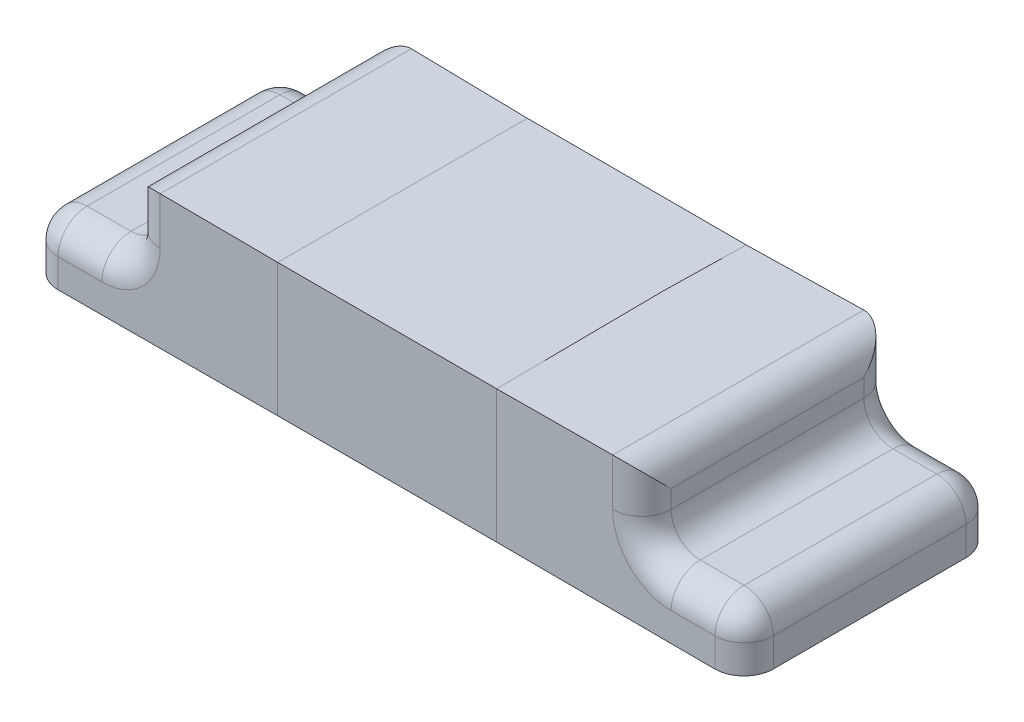
ISO-10303-21;
HEADER;
FILE_DESCRIPTION(('STEP AP214'),'2;1');
FILE_NAME('part.step','',(''),(''),'','','');
FILE_SCHEMA(('AUTOMOTIVE_DESIGN { 1 0 10303 214 1 1 1 1 }'));
ENDSEC;
DATA;
#1=APPLICATION_CONTEXT('core data for automotive mechanical design processes');
#2=APPLICATION_PROTOCOL_DEFINITION('international standard','automotive_design',2000,#1);
#3=PRODUCT_CONTEXT('',#1,'mechanical');
#4=PRODUCT('Part','Part','',(#3));
#5=PRODUCT_RELATED_PRODUCT_CATEGORY('part','',(#4));
#6=PRODUCT_DEFINITION_FORMATION('','',#4);
#7=PRODUCT_DEFINITION_CONTEXT('part definition',#1,'design');
#8=PRODUCT_DEFINITION('design','',#6,#7);
#9=PRODUCT_DEFINITION_SHAPE('','',#8);
#10=(LENGTH_UNIT() NAMED_UNIT(*) SI_UNIT(.MILLI.,.METRE.));
#11=(NAMED_UNIT(*) PLANE_ANGLE_UNIT() SI_UNIT($,.RADIAN.));
#12=(NAMED_UNIT(*) SI_UNIT($,.STERADIAN.) SOLID_ANGLE_UNIT());
#13=UNCERTAINTY_MEASURE_WITH_UNIT(LENGTH_MEASURE(1.E-05),#10,'distance_accuracy_value','');
#14=(GEOMETRIC_REPRESENTATION_CONTEXT(3) GLOBAL_UNCERTAINTY_ASSIGNED_CONTEXT((#13)) GLOBAL_UNIT_ASSIGNED_CONTEXT((#10,
#11,#12)) REPRESENTATION_CONTEXT('',''));
#15=CARTESIAN_POINT('',(0.,0.,0.));
#16=DIRECTION('',(0.,0.,1.));
#17=DIRECTION('',(1.,0.,0.));
#18=AXIS2_PLACEMENT_3D('',#15,#16,#17);
#19=CARTESIAN_POINT('',(0.875,0.,0.));
#20=DIRECTION('',(-1.,0.,0.));
#21=DIRECTION('',(0.,0.,1.));
#22=AXIS2_PLACEMENT_3D('',#19,#20,#21);
#23=PLANE('',#22);
#24=DIRECTION('',(0.,1.,0.));
#25=VECTOR('',#24,1.);
#26=CARTESIAN_POINT('',(0.875,0.,-0.33));
#27=LINE('',#26,#25);
#28=CARTESIAN_POINT('',(0.875,0.298442990090282,-0.33));
#29=VERTEX_POINT('',#28);
#30=CARTESIAN_POINT('',(0.875,0.36,-0.33));
#31=VERTEX_POINT('',#30);
#32=EDGE_CURVE('E508',#29,#31,#27,.T.);
#33=ORIENTED_EDGE('',*,*,#32,.T.);
#34=DIRECTION('',(0.,0.,1.));
#35=VECTOR('',#34,1.);
#36=CARTESIAN_POINT('',(0.875,0.36,0.));
#37=LINE('',#36,#35);
#38=CARTESIAN_POINT('',(0.875,0.36,0.33));
#39=VERTEX_POINT('',#38);
#40=EDGE_CURVE('E483',#31,#39,#37,.T.);
#41=ORIENTED_EDGE('',*,*,#40,.T.);
#42=DIRECTION('',(0.,-1.,0.));
#43=VECTOR('',#42,1.);
#44=CARTESIAN_POINT('',(0.875,0.,0.33));
#45=LINE('',#44,#43);
#46=CARTESIAN_POINT('',(0.875,0.298442990090282,0.33));
#47=VERTEX_POINT('',#46);
#48=EDGE_CURVE('E511',#39,#47,#45,.T.);
#49=ORIENTED_EDGE('',*,*,#48,.T.);
#50=DIRECTION('',(0.,0.,1.));
#51=VECTOR('',#50,1.);
#52=CARTESIAN_POINT('',(0.875,0.298442990090282,-0.43));
#53=LINE('',#52,#51);
#54=EDGE_CURVE('E273',#47,#29,#53,.F.);
#55=ORIENTED_EDGE('',*,*,#54,.T.);
#56=EDGE_LOOP('',(#33,#41,#49,#55));
#57=FACE_BOUND('',#56,.T.);
#58=ADVANCED_FACE('F40',(#57),#23,.F.);
#59=CARTESIAN_POINT('',(0.375,0.,-0.425));
#60=DIRECTION('',(0.,0.,1.));
#61=DIRECTION('',(1.,0.,0.));
#62=AXIS2_PLACEMENT_3D('',#59,#60,#61);
#63=PLANE('',#62);
#64=CARTESIAN_POINT('',(-0.375,0.,-0.425));
#65=DIRECTION('',(0.,1.,0.));
#66=VECTOR('',#65,1.);
#67=LINE('',#64,#66);
#68=CARTESIAN_POINT('',(-0.375,0.,-0.4275));
#69=VERTEX_POINT('',#68);
#70=CARTESIAN_POINT('',(-0.375,0.455,-0.4275));
#71=VERTEX_POINT('',#70);
#72=EDGE_CURVE('E233',#69,#71,#67,.T.);
#73=ORIENTED_EDGE('',*,*,#72,.T.);
#74=DIRECTION('',(-1.,0.,0.));
#75=VECTOR('',#74,1.);
#76=CARTESIAN_POINT('',(0.375,0.45,-0.425));
#77=LINE('',#76,#75);
#78=CARTESIAN_POINT('',(0.375,0.454472135955,-0.4272360679775));
#79=VERTEX_POINT('',#78);
#80=EDGE_CURVE('E270',#79,#71,#77,.T.);
#81=ORIENTED_EDGE('',*,*,#80,.F.);
#82=CARTESIAN_POINT('',(0.375,0.,-0.43));
#83=DIRECTION('',(0.,1.,0.));
#84=VECTOR('',#83,1.);
#85=LINE('',#82,#84);
#86=CARTESIAN_POINT('',(0.375,0.,-0.4275));
#87=VERTEX_POINT('',#86);
#88=EDGE_CURVE('E249',#87,#79,#85,.T.);
#89=ORIENTED_EDGE('',*,*,#88,.F.);
#90=DIRECTION('',(-1.,0.,0.));
#91=VECTOR('',#90,1.);
#92=CARTESIAN_POINT('',(0.375,0.,-0.425));
#93=LINE('',#92,#91);
#94=EDGE_CURVE('E222',#87,#69,#93,.T.);
#95=ORIENTED_EDGE('',*,*,#94,.T.);
#96=EDGE_LOOP('',(#73,#81,#89,#95));
#97=FACE_BOUND('',#96,.T.);
#98=ADVANCED_FACE('F247',(#97),#63,.F.);
#99=CARTESIAN_POINT('',(0.375,0.45,0.425));
#100=DIRECTION('',(0.,-1.,0.));
#101=DIRECTION('',(0.,0.,-1.));
#102=AXIS2_PLACEMENT_3D('',#99,#100,#101);
#103=PLANE('',#102);
#104=CARTESIAN_POINT('',(-0.375,0.45,-0.425));
#105=DIRECTION('',(0.,0.,1.));
#106=VECTOR('',#105,1.);
#107=LINE('',#104,#106);
#108=CARTESIAN_POINT('',(-0.375,0.455,0.4275));
#109=VERTEX_POINT('',#108);
#110=EDGE_CURVE('E243',#71,#109,#107,.T.);
#111=ORIENTED_EDGE('',*,*,#110,.T.);
#112=DIRECTION('',(-1.,0.,0.));
#113=VECTOR('',#112,1.);
#114=CARTESIAN_POINT('',(0.375,0.45,0.425));
#115=LINE('',#114,#113);
#116=CARTESIAN_POINT('',(0.375,0.455,0.4275));
#117=VERTEX_POINT('',#116);
#118=EDGE_CURVE('E255',#117,#109,#115,.T.);
#119=ORIENTED_EDGE('',*,*,#118,.F.);
#120=DIRECTION('',(0.,0.,1.));
#121=VECTOR('',#120,1.);
#122=CARTESIAN_POINT('',(0.375,0.45,0.425));
#123=LINE('',#122,#121);
#124=EDGE_CURVE('E258',#79,#117,#123,.T.);
#125=ORIENTED_EDGE('',*,*,#124,.F.);
#126=ORIENTED_EDGE('',*,*,#80,.T.);
#127=EDGE_LOOP('',(#111,#119,#125,#126));
#128=FACE_BOUND('',#127,.T.);
#129=ADVANCED_FACE('F297',(#128),#103,.F.);
#130=CARTESIAN_POINT('',(0.375,0.,0.425));
#131=DIRECTION('',(0.,0.,-1.));
#132=DIRECTION('',(-1.,0.,0.));
#133=AXIS2_PLACEMENT_3D('',#130,#131,#132);
#134=PLANE('',#133);
#135=CARTESIAN_POINT('',(-0.375,0.45,0.425));
#136=DIRECTION('',(0.,-1.,0.));
#137=VECTOR('',#136,1.);
#138=LINE('',#135,#137);
#139=CARTESIAN_POINT('',(-0.375,0.,0.4275));
#140=VERTEX_POINT('',#139);
#141=EDGE_CURVE('E338',#109,#140,#138,.T.);
#142=ORIENTED_EDGE('',*,*,#141,.T.);
#143=DIRECTION('',(-1.,0.,0.));
#144=VECTOR('',#143,1.);
#145=CARTESIAN_POINT('',(0.375,0.,0.425));
#146=LINE('',#145,#144);
#147=CARTESIAN_POINT('',(0.375,0.,0.4275));
#148=VERTEX_POINT('',#147);
#149=EDGE_CURVE('E251',#148,#140,#146,.T.);
#150=ORIENTED_EDGE('',*,*,#149,.F.);
#151=CARTESIAN_POINT('',(0.375,0.46,0.43));
#152=DIRECTION('',(0.,-1.,0.));
#153=VECTOR('',#152,1.);
#154=LINE('',#151,#153);
#155=EDGE_CURVE('E252',#117,#148,#154,.T.);
#156=ORIENTED_EDGE('',*,*,#155,.F.);
#157=ORIENTED_EDGE('',*,*,#118,.T.);
#158=EDGE_LOOP('',(#142,#150,#156,#157));
#159=FACE_BOUND('',#158,.T.);
#160=ADVANCED_FACE('F287',(#159),#134,.F.);
#161=CARTESIAN_POINT('',(0.375,0.,0.425));
#162=DIRECTION('',(0.,1.,0.));
#163=DIRECTION('',(0.,0.,1.));
#164=AXIS2_PLACEMENT_3D('',#161,#162,#163);
#165=PLANE('',#164);
#166=DIRECTION('',(0.,0.,-1.));
#167=VECTOR('',#166,1.);
#168=CARTESIAN_POINT('',(-1.225,0.,0.43));
#169=LINE('',#168,#167);
#170=CARTESIAN_POINT('',(-1.225,0.,0.33));
#171=VERTEX_POINT('',#170);
#172=CARTESIAN_POINT('',(-1.225,0.,-0.33));
#173=VERTEX_POINT('',#172);
#174=EDGE_CURVE('E327',#171,#173,#169,.T.);
#175=ORIENTED_EDGE('',*,*,#174,.T.);
#176=CARTESIAN_POINT('',(-1.125,0.,-0.33));
#177=DIRECTION('',(0.,1.,0.));
#178=DIRECTION('',(0.,0.,1.));
#179=AXIS2_PLACEMENT_3D('',#176,#177,#178);
#180=CIRCLE('',#179,0.1);
#181=CARTESIAN_POINT('',(-1.125,0.,-0.43));
#182=VERTEX_POINT('',#181);
#183=EDGE_CURVE('E225',#173,#182,#180,.F.);
#184=ORIENTED_EDGE('',*,*,#183,.T.);
#185=DIRECTION('',(1.,0.,0.));
#186=VECTOR('',#185,1.);
#187=CARTESIAN_POINT('',(-0.875,0.,-0.43));
#188=LINE('',#187,#186);
#189=EDGE_CURVE('E216',#182,#69,#188,.T.);
#190=ORIENTED_EDGE('',*,*,#189,.T.);
#191=ORIENTED_EDGE('',*,*,#94,.F.);
#192=DIRECTION('',(-1.,0.,0.));
#193=VECTOR('',#192,1.);
#194=CARTESIAN_POINT('',(0.875,0.,-0.43));
#195=LINE('',#194,#193);
#196=CARTESIAN_POINT('',(1.125,0.,-0.43));
#197=VERTEX_POINT('',#196);
#198=EDGE_CURVE('E465',#197,#87,#195,.T.);
#199=ORIENTED_EDGE('',*,*,#198,.F.);
#200=CARTESIAN_POINT('',(1.125,0.,-0.33));
#201=DIRECTION('',(0.,1.,0.));
#202=DIRECTION('',(0.,0.,1.));
#203=AXIS2_PLACEMENT_3D('',#200,#201,#202);
#204=CIRCLE('',#203,0.1);
#205=CARTESIAN_POINT('',(1.225,0.,-0.33));
#206=VERTEX_POINT('',#205);
#207=EDGE_CURVE('E663',#197,#206,#204,.F.);
#208=ORIENTED_EDGE('',*,*,#207,.T.);
#209=DIRECTION('',(0.,0.,-1.));
#210=VECTOR('',#209,1.);
#211=CARTESIAN_POINT('',(1.225,0.,0.43));
#212=LINE('',#211,#210);
#213=CARTESIAN_POINT('',(1.225,0.,0.33));
#214=VERTEX_POINT('',#213);
#215=EDGE_CURVE('E458',#214,#206,#212,.T.);
#216=ORIENTED_EDGE('',*,*,#215,.F.);
#217=CARTESIAN_POINT('',(1.125,0.,0.33));
#218=DIRECTION('',(0.,1.,0.));
#219=DIRECTION('',(0.,0.,1.));
#220=AXIS2_PLACEMENT_3D('',#217,#218,#219);
#221=CIRCLE('',#220,0.1);
#222=CARTESIAN_POINT('',(1.125,0.,0.43));
#223=VERTEX_POINT('',#222);
#224=EDGE_CURVE('E659',#214,#223,#221,.F.);
#225=ORIENTED_EDGE('',*,*,#224,.T.);
#226=DIRECTION('',(-1.,0.,0.));
#227=VECTOR('',#226,1.);
#228=CARTESIAN_POINT('',(0.875,0.,0.43));
#229=LINE('',#228,#227);
#230=EDGE_CURVE('E409',#223,#148,#229,.T.);
#231=ORIENTED_EDGE('',*,*,#230,.T.);
#232=ORIENTED_EDGE('',*,*,#149,.T.);
#233=DIRECTION('',(1.,0.,0.));
#234=VECTOR('',#233,1.);
#235=CARTESIAN_POINT('',(-0.875,0.,0.43));
#236=LINE('',#235,#234);
#237=CARTESIAN_POINT('',(-1.125,0.,0.43));
#238=VERTEX_POINT('',#237);
#239=EDGE_CURVE('E230',#238,#140,#236,.T.);
#240=ORIENTED_EDGE('',*,*,#239,.F.);
#241=CARTESIAN_POINT('',(-1.125,0.,0.33));
#242=DIRECTION('',(0.,1.,0.));
#243=DIRECTION('',(0.,0.,1.));
#244=AXIS2_PLACEMENT_3D('',#241,#242,#243);
#245=CIRCLE('',#244,0.1);
#246=EDGE_CURVE('E63',#238,#171,#245,.F.);
#247=ORIENTED_EDGE('',*,*,#246,.T.);
#248=EDGE_LOOP('',(#175,#184,#190,#191,#199,#208,#216,#225,#231,#232,#240,#247));
#249=FACE_BOUND('',#248,.T.);
#250=ADVANCED_FACE('F219',(#249),#165,.F.);
#251=CARTESIAN_POINT('',(0.875,0.,-0.43));
#252=DIRECTION('',(0.,0.,1.));
#253=DIRECTION('',(1.,0.,0.));
#254=AXIS2_PLACEMENT_3D('',#251,#252,#253);
#255=PLANE('',#254);
#256=DIRECTION('',(-1.,0.,0.));
#257=VECTOR('',#256,1.);
#258=CARTESIAN_POINT('',(0.875,0.098442990090282,-0.43));
#259=LINE('',#258,#257);
#260=CARTESIAN_POINT('',(0.975,0.098442990090282,-0.43));
#261=VERTEX_POINT('',#260);
#262=CARTESIAN_POINT('',(1.125,0.098442990090282,-0.43));
#263=VERTEX_POINT('',#262);
#264=EDGE_CURVE('E485',#261,#263,#259,.F.);
#265=ORIENTED_EDGE('',*,*,#264,.T.);
#266=DIRECTION('',(0.,1.,0.));
#267=VECTOR('',#266,1.);
#268=CARTESIAN_POINT('',(1.125,0.,-0.43));
#269=LINE('',#268,#267);
#270=EDGE_CURVE('E464',#263,#197,#269,.F.);
#271=ORIENTED_EDGE('',*,*,#270,.T.);
#272=ORIENTED_EDGE('',*,*,#198,.T.);
#273=ORIENTED_EDGE('',*,*,#88,.T.);
#274=DIRECTION('',(-1.,0.,0.));
#275=VECTOR('',#274,1.);
#276=CARTESIAN_POINT('',(0.875,0.46,-0.43));
#277=LINE('',#276,#275);
#278=CARTESIAN_POINT('',(0.775,0.46,-0.43));
#279=VERTEX_POINT('',#278);
#280=EDGE_CURVE('E244',#279,#79,#277,.T.);
#281=ORIENTED_EDGE('',*,*,#280,.F.);
#282=DIRECTION('',(0.,1.,0.));
#283=VECTOR('',#282,1.);
#284=CARTESIAN_POINT('',(0.775,0.,-0.43));
#285=LINE('',#284,#283);
#286=CARTESIAN_POINT('',(0.775,0.298442990090282,-0.43));
#287=VERTEX_POINT('',#286);
#288=EDGE_CURVE('E410',#279,#287,#285,.F.);
#289=ORIENTED_EDGE('',*,*,#288,.T.);
#290=CARTESIAN_POINT('',(0.975,0.298442990090282,-0.43));
#291=DIRECTION('',(0.,0.,1.));
#292=DIRECTION('',(1.,0.,0.));
#293=AXIS2_PLACEMENT_3D('',#290,#291,#292);
#294=CIRCLE('',#293,0.2);
#295=EDGE_CURVE('E487',#261,#287,#294,.F.);
#296=ORIENTED_EDGE('',*,*,#295,.F.);
#297=EDGE_LOOP('',(#265,#271,#272,#273,#281,#289,#296));
#298=FACE_BOUND('',#297,.T.);
#299=ADVANCED_FACE('F495',(#298),#255,.F.);
#300=CARTESIAN_POINT('',(0.875,0.46,0.43));
#301=DIRECTION('',(0.,-1.,0.));
#302=DIRECTION('',(0.,0.,-1.));
#303=AXIS2_PLACEMENT_3D('',#300,#301,#302);
#304=PLANE('',#303);
#305=DIRECTION('',(-1.,0.,0.));
#306=VECTOR('',#305,1.);
#307=CARTESIAN_POINT('',(0.875,0.46,0.43));
#308=LINE('',#307,#306);
#309=CARTESIAN_POINT('',(0.775,0.46,0.43));
#310=VERTEX_POINT('',#309);
#311=EDGE_CURVE('E406',#310,#117,#308,.T.);
#312=ORIENTED_EDGE('',*,*,#311,.F.);
#313=DIRECTION('',(0.,0.,1.));
#314=VECTOR('',#313,1.);
#315=CARTESIAN_POINT('',(0.775,0.46,0.43));
#316=LINE('',#315,#314);
#317=EDGE_CURVE('E419',#310,#279,#316,.F.);
#318=ORIENTED_EDGE('',*,*,#317,.T.);
#319=ORIENTED_EDGE('',*,*,#280,.T.);
#320=DIRECTION('',(0.,0.,1.));
#321=VECTOR('',#320,1.);
#322=CARTESIAN_POINT('',(0.375,0.46,0.43));
#323=LINE('',#322,#321);
#324=EDGE_CURVE('E468',#79,#117,#323,.T.);
#325=ORIENTED_EDGE('',*,*,#324,.T.);
#326=EDGE_LOOP('',(#312,#318,#319,#325));
#327=FACE_BOUND('',#326,.T.);
#328=ADVANCED_FACE('F389',(#327),#304,.F.);
#329=CARTESIAN_POINT('',(0.875,0.,0.43));
#330=DIRECTION('',(0.,0.,-1.));
#331=DIRECTION('',(-1.,0.,0.));
#332=AXIS2_PLACEMENT_3D('',#329,#330,#331);
#333=PLANE('',#332);
#334=ORIENTED_EDGE('',*,*,#230,.F.);
#335=DIRECTION('',(0.,-1.,0.));
#336=VECTOR('',#335,1.);
#337=CARTESIAN_POINT('',(1.125,0.,0.43));
#338=LINE('',#337,#336);
#339=CARTESIAN_POINT('',(1.125,0.098442990090282,0.43));
#340=VERTEX_POINT('',#339);
#341=EDGE_CURVE('E665',#223,#340,#338,.F.);
#342=ORIENTED_EDGE('',*,*,#341,.T.);
#343=DIRECTION('',(-1.,0.,0.));
#344=VECTOR('',#343,1.);
#345=CARTESIAN_POINT('',(0.875,0.098442990090282,0.43));
#346=LINE('',#345,#344);
#347=CARTESIAN_POINT('',(0.975,0.098442990090282,0.43));
#348=VERTEX_POINT('',#347);
#349=EDGE_CURVE('E415',#340,#348,#346,.T.);
#350=ORIENTED_EDGE('',*,*,#349,.T.);
#351=CARTESIAN_POINT('',(0.975,0.298442990090282,0.43));
#352=DIRECTION('',(0.,0.,-1.));
#353=DIRECTION('',(-1.,0.,0.));
#354=AXIS2_PLACEMENT_3D('',#351,#352,#353);
#355=CIRCLE('',#354,0.2);
#356=CARTESIAN_POINT('',(0.775,0.298442990090282,0.43));
#357=VERTEX_POINT('',#356);
#358=EDGE_CURVE('E412',#357,#348,#355,.F.);
#359=ORIENTED_EDGE('',*,*,#358,.F.);
#360=DIRECTION('',(0.,-1.,0.));
#361=VECTOR('',#360,1.);
#362=CARTESIAN_POINT('',(0.775,0.,0.43));
#363=LINE('',#362,#361);
#364=EDGE_CURVE('E417',#357,#310,#363,.F.);
#365=ORIENTED_EDGE('',*,*,#364,.T.);
#366=ORIENTED_EDGE('',*,*,#311,.T.);
#367=ORIENTED_EDGE('',*,*,#155,.T.);
#368=EDGE_LOOP('',(#334,#342,#350,#359,#365,#366,#367));
#369=FACE_BOUND('',#368,.T.);
#370=ADVANCED_FACE('F384',(#369),#333,.F.);
#371=CARTESIAN_POINT('',(0.375,0.,0.));
#372=DIRECTION('',(-1.,0.,0.));
#373=DIRECTION('',(0.,0.,1.));
#374=AXIS2_PLACEMENT_3D('',#371,#372,#373);
#375=PLANE('',#374);
#376=ORIENTED_EDGE('',*,*,#324,.F.);
#377=ORIENTED_EDGE('',*,*,#124,.T.);
#378=EDGE_LOOP('',(#376,#377));
#379=FACE_BOUND('',#378,.T.);
#380=ADVANCED_FACE('F377',(#379),#375,.T.);
#381=CARTESIAN_POINT('',(1.225,0.198442990090282,0.43));
#382=DIRECTION('',(0.,-1.,0.));
#383=DIRECTION('',(0.,0.,-1.));
#384=AXIS2_PLACEMENT_3D('',#381,#382,#383);
#385=PLANE('',#384);
#386=DIRECTION('',(-1.,0.,0.));
#387=VECTOR('',#386,1.);
#388=CARTESIAN_POINT('',(1.225,0.198442990090282,-0.33));
#389=LINE('',#388,#387);
#390=CARTESIAN_POINT('',(1.125,0.198442990090282,-0.33));
#391=VERTEX_POINT('',#390);
#392=CARTESIAN_POINT('',(0.975,0.198442990090282,-0.33));
#393=VERTEX_POINT('',#392);
#394=EDGE_CURVE('E427',#391,#393,#389,.T.);
#395=ORIENTED_EDGE('',*,*,#394,.T.);
#396=DIRECTION('',(0.,0.,1.));
#397=VECTOR('',#396,1.);
#398=CARTESIAN_POINT('',(0.975,0.198442990090282,0.43));
#399=LINE('',#398,#397);
#400=CARTESIAN_POINT('',(0.975,0.198442990090282,0.33));
#401=VERTEX_POINT('',#400);
#402=EDGE_CURVE('E430',#393,#401,#399,.T.);
#403=ORIENTED_EDGE('',*,*,#402,.T.);
#404=DIRECTION('',(-1.,0.,0.));
#405=VECTOR('',#404,1.);
#406=CARTESIAN_POINT('',(1.225,0.198442990090282,0.33));
#407=LINE('',#406,#405);
#408=CARTESIAN_POINT('',(1.125,0.198442990090282,0.33));
#409=VERTEX_POINT('',#408);
#410=EDGE_CURVE('E424',#401,#409,#407,.F.);
#411=ORIENTED_EDGE('',*,*,#410,.T.);
#412=DIRECTION('',(0.,0.,1.));
#413=VECTOR('',#412,1.);
#414=CARTESIAN_POINT('',(1.125,0.198442990090282,0.43));
#415=LINE('',#414,#413);
#416=EDGE_CURVE('E421',#409,#391,#415,.F.);
#417=ORIENTED_EDGE('',*,*,#416,.T.);
#418=EDGE_LOOP('',(#395,#403,#411,#417));
#419=FACE_BOUND('',#418,.T.);
#420=ADVANCED_FACE('F373',(#419),#385,.F.);
#421=CARTESIAN_POINT('',(1.225,0.,0.));
#422=DIRECTION('',(-1.,0.,0.));
#423=DIRECTION('',(0.,0.,1.));
#424=AXIS2_PLACEMENT_3D('',#421,#422,#423);
#425=PLANE('',#424);
#426=ORIENTED_EDGE('',*,*,#215,.T.);
#427=DIRECTION('',(0.,1.,0.));
#428=VECTOR('',#427,1.);
#429=CARTESIAN_POINT('',(1.225,0.,-0.33));
#430=LINE('',#429,#428);
#431=CARTESIAN_POINT('',(1.225,0.098442990090282,-0.33));
#432=VERTEX_POINT('',#431);
#433=EDGE_CURVE('E461',#206,#432,#430,.T.);
#434=ORIENTED_EDGE('',*,*,#433,.T.);
#435=DIRECTION('',(0.,0.,1.));
#436=VECTOR('',#435,1.);
#437=CARTESIAN_POINT('',(1.225,0.098442990090282,0.));
#438=LINE('',#437,#436);
#439=CARTESIAN_POINT('',(1.225,0.098442990090282,0.33));
#440=VERTEX_POINT('',#439);
#441=EDGE_CURVE('E432',#432,#440,#438,.T.);
#442=ORIENTED_EDGE('',*,*,#441,.T.);
#443=DIRECTION('',(0.,-1.,0.));
#444=VECTOR('',#443,1.);
#445=CARTESIAN_POINT('',(1.225,0.,0.33));
#446=LINE('',#445,#444);
#447=EDGE_CURVE('E435',#440,#214,#446,.T.);
#448=ORIENTED_EDGE('',*,*,#447,.T.);
#449=EDGE_LOOP('',(#426,#434,#442,#448));
#450=FACE_BOUND('',#449,.T.);
#451=ADVANCED_FACE('F362',(#450),#425,.F.);
#452=CARTESIAN_POINT('',(0.875,0.098442990090282,0.33));
#453=DIRECTION('',(-1.,0.,0.));
#454=DIRECTION('',(0.,0.,1.));
#455=AXIS2_PLACEMENT_3D('',#452,#453,#454);
#456=CYLINDRICAL_SURFACE('',#455,0.1);
#457=ORIENTED_EDGE('',*,*,#349,.F.);
#458=CARTESIAN_POINT('',(1.125,0.098442990090282,0.33));
#459=DIRECTION('',(-1.,0.,0.));
#460=DIRECTION('',(0.,0.,1.));
#461=AXIS2_PLACEMENT_3D('',#458,#459,#460);
#462=CIRCLE('',#461,0.1);
#463=EDGE_CURVE('E673',#340,#409,#462,.T.);
#464=ORIENTED_EDGE('',*,*,#463,.T.);
#465=ORIENTED_EDGE('',*,*,#410,.F.);
#466=CARTESIAN_POINT('',(0.975,0.098442990090282,0.33));
#467=DIRECTION('',(-1.,0.,0.));
#468=DIRECTION('',(0.,0.,1.));
#469=AXIS2_PLACEMENT_3D('',#466,#467,#468);
#470=CIRCLE('',#469,0.1);
#471=EDGE_CURVE('E455',#348,#401,#470,.T.);
#472=ORIENTED_EDGE('',*,*,#471,.F.);
#473=EDGE_LOOP('',(#457,#464,#465,#472));
#474=FACE_BOUND('',#473,.T.);
#475=ADVANCED_FACE('F372',(#474),#456,.T.);
#476=CARTESIAN_POINT('',(1.125,0.098442990090282,0.));
#477=DIRECTION('',(0.,0.,1.));
#478=DIRECTION('',(1.,0.,0.));
#479=AXIS2_PLACEMENT_3D('',#476,#477,#478);
#480=CYLINDRICAL_SURFACE('',#479,0.1);
#481=ORIENTED_EDGE('',*,*,#441,.F.);
#482=CARTESIAN_POINT('',(1.125,0.098442990090282,-0.33));
#483=DIRECTION('',(0.,0.,1.));
#484=DIRECTION('',(1.,0.,0.));
#485=AXIS2_PLACEMENT_3D('',#482,#483,#484);
#486=CIRCLE('',#485,0.1);
#487=EDGE_CURVE('E671',#432,#391,#486,.T.);
#488=ORIENTED_EDGE('',*,*,#487,.T.);
#489=ORIENTED_EDGE('',*,*,#416,.F.);
#490=CARTESIAN_POINT('',(1.125,0.098442990090282,0.33));
#491=DIRECTION('',(0.,0.,1.));
#492=DIRECTION('',(1.,0.,0.));
#493=AXIS2_PLACEMENT_3D('',#490,#491,#492);
#494=CIRCLE('',#493,0.1);
#495=EDGE_CURVE('E669',#409,#440,#494,.F.);
#496=ORIENTED_EDGE('',*,*,#495,.T.);
#497=EDGE_LOOP('',(#481,#488,#489,#496));
#498=FACE_BOUND('',#497,.T.);
#499=ADVANCED_FACE('F548',(#498),#480,.T.);
#500=CARTESIAN_POINT('',(0.975,0.298442990090282,0.33));
#501=DIRECTION('',(0.,0.,-1.));
#502=DIRECTION('',(-1.,0.,0.));
#503=AXIS2_PLACEMENT_3D('',#500,#501,#502);
#504=TOROIDAL_SURFACE('',#503,0.2,0.1);
#505=ORIENTED_EDGE('',*,*,#358,.T.);
#506=ORIENTED_EDGE('',*,*,#471,.T.);
#507=CARTESIAN_POINT('',(0.975,0.298442990090282,0.33));
#508=DIRECTION('',(0.,0.,-1.));
#509=DIRECTION('',(-1.,0.,0.));
#510=AXIS2_PLACEMENT_3D('',#507,#508,#509);
#511=CIRCLE('',#510,0.1);
#512=EDGE_CURVE('E452',#47,#401,#511,.F.);
#513=ORIENTED_EDGE('',*,*,#512,.F.);
#514=CARTESIAN_POINT('',(0.775,0.298442990090282,0.33));
#515=DIRECTION('',(0.,-1.,0.));
#516=DIRECTION('',(0.,0.,-1.));
#517=AXIS2_PLACEMENT_3D('',#514,#515,#516);
#518=CIRCLE('',#517,0.1);
#519=EDGE_CURVE('E449',#357,#47,#518,.F.);
#520=ORIENTED_EDGE('',*,*,#519,.F.);
#521=EDGE_LOOP('',(#505,#506,#513,#520));
#522=FACE_BOUND('',#521,.T.);
#523=ADVANCED_FACE('F523',(#522),#504,.T.);
#524=CARTESIAN_POINT('',(1.225,0.098442990090282,-0.33));
#525=DIRECTION('',(-1.,0.,0.));
#526=DIRECTION('',(0.,0.,1.));
#527=AXIS2_PLACEMENT_3D('',#524,#525,#526);
#528=CYLINDRICAL_SURFACE('',#527,0.1);
#529=ORIENTED_EDGE('',*,*,#394,.F.);
#530=CARTESIAN_POINT('',(1.125,0.098442990090282,-0.33));
#531=DIRECTION('',(-1.,0.,0.));
#532=DIRECTION('',(0.,0.,1.));
#533=AXIS2_PLACEMENT_3D('',#530,#531,#532);
#534=CIRCLE('',#533,0.1);
#535=EDGE_CURVE('E667',#391,#263,#534,.T.);
#536=ORIENTED_EDGE('',*,*,#535,.T.);
#537=ORIENTED_EDGE('',*,*,#264,.F.);
#538=CARTESIAN_POINT('',(0.975,0.098442990090282,-0.33));
#539=DIRECTION('',(-1.,0.,0.));
#540=DIRECTION('',(0.,0.,1.));
#541=AXIS2_PLACEMENT_3D('',#538,#539,#540);
#542=CIRCLE('',#541,0.1);
#543=EDGE_CURVE('E446',#393,#261,#542,.T.);
#544=ORIENTED_EDGE('',*,*,#543,.F.);
#545=EDGE_LOOP('',(#529,#536,#537,#544));
#546=FACE_BOUND('',#545,.T.);
#547=ADVANCED_FACE('F542',(#546),#528,.T.);
#548=CARTESIAN_POINT('',(0.975,0.298442990090282,0.43));
#549=DIRECTION('',(0.,0.,-1.));
#550=DIRECTION('',(-1.,0.,0.));
#551=AXIS2_PLACEMENT_3D('',#548,#549,#550);
#552=CYLINDRICAL_SURFACE('',#551,0.1);
#553=ORIENTED_EDGE('',*,*,#512,.T.);
#554=ORIENTED_EDGE('',*,*,#402,.F.);
#555=CARTESIAN_POINT('',(0.975,0.298442990090282,-0.33));
#556=DIRECTION('',(0.,0.,1.));
#557=DIRECTION('',(1.,0.,0.));
#558=AXIS2_PLACEMENT_3D('',#555,#556,#557);
#559=CIRCLE('',#558,0.1);
#560=EDGE_CURVE('E444',#29,#393,#559,.T.);
#561=ORIENTED_EDGE('',*,*,#560,.F.);
#562=ORIENTED_EDGE('',*,*,#54,.F.);
#563=EDGE_LOOP('',(#553,#554,#561,#562));
#564=FACE_BOUND('',#563,.T.);
#565=ADVANCED_FACE('F527',(#564),#552,.F.);
#566=CARTESIAN_POINT('',(0.775,0.,0.33));
#567=DIRECTION('',(0.,-1.,0.));
#568=DIRECTION('',(0.,0.,-1.));
#569=AXIS2_PLACEMENT_3D('',#566,#567,#568);
#570=CYLINDRICAL_SURFACE('',#569,0.1);
#571=ORIENTED_EDGE('',*,*,#519,.T.);
#572=ORIENTED_EDGE('',*,*,#48,.F.);
#573=CARTESIAN_POINT('',(0.775,0.36,0.33));
#574=DIRECTION('',(0.,-0.707106781186547,0.707106781186547));
#575=DIRECTION('',(0.,0.707106781186547,0.707106781186547));
#576=AXIS2_PLACEMENT_3D('',#573,#574,#575);
#577=ELLIPSE('',#576,0.14142135623731,0.1);
#578=EDGE_CURVE('E441',#310,#39,#577,.F.);
#579=ORIENTED_EDGE('',*,*,#578,.F.);
#580=ORIENTED_EDGE('',*,*,#364,.F.);
#581=EDGE_LOOP('',(#571,#572,#579,#580));
#582=FACE_BOUND('',#581,.T.);
#583=ADVANCED_FACE('F521',(#582),#570,.T.);
#584=CARTESIAN_POINT('',(0.975,0.298442990090282,-0.33));
#585=DIRECTION('',(0.,0.,1.));
#586=DIRECTION('',(1.,0.,0.));
#587=AXIS2_PLACEMENT_3D('',#584,#585,#586);
#588=TOROIDAL_SURFACE('',#587,0.2,0.1);
#589=ORIENTED_EDGE('',*,*,#543,.T.);
#590=ORIENTED_EDGE('',*,*,#295,.T.);
#591=CARTESIAN_POINT('',(0.775,0.298442990090282,-0.33));
#592=DIRECTION('',(0.,-1.,0.));
#593=DIRECTION('',(0.,0.,-1.));
#594=AXIS2_PLACEMENT_3D('',#591,#592,#593);
#595=CIRCLE('',#594,0.1);
#596=EDGE_CURVE('E438',#29,#287,#595,.F.);
#597=ORIENTED_EDGE('',*,*,#596,.F.);
#598=ORIENTED_EDGE('',*,*,#560,.T.);
#599=EDGE_LOOP('',(#589,#590,#597,#598));
#600=FACE_BOUND('',#599,.T.);
#601=ADVANCED_FACE('F529',(#600),#588,.T.);
#602=CARTESIAN_POINT('',(0.775,0.36,0.));
#603=DIRECTION('',(0.,0.,1.));
#604=DIRECTION('',(1.,0.,0.));
#605=AXIS2_PLACEMENT_3D('',#602,#603,#604);
#606=CYLINDRICAL_SURFACE('',#605,0.1);
#607=ORIENTED_EDGE('',*,*,#578,.T.);
#608=ORIENTED_EDGE('',*,*,#40,.F.);
#609=CARTESIAN_POINT('',(0.775,0.36,-0.33));
#610=DIRECTION('',(0.,0.707106781186547,0.707106781186547));
#611=DIRECTION('',(0.,-0.707106781186547,0.707106781186547));
#612=AXIS2_PLACEMENT_3D('',#609,#610,#611);
#613=ELLIPSE('',#612,0.14142135623731,0.1);
#614=EDGE_CURVE('E436',#279,#31,#613,.F.);
#615=ORIENTED_EDGE('',*,*,#614,.F.);
#616=ORIENTED_EDGE('',*,*,#317,.F.);
#617=EDGE_LOOP('',(#607,#608,#615,#616));
#618=FACE_BOUND('',#617,.T.);
#619=ADVANCED_FACE('F504',(#618),#606,.T.);
#620=CARTESIAN_POINT('',(0.775,0.,-0.33));
#621=DIRECTION('',(0.,1.,0.));
#622=DIRECTION('',(0.,0.,1.));
#623=AXIS2_PLACEMENT_3D('',#620,#621,#622);
#624=CYLINDRICAL_SURFACE('',#623,0.1);
#625=ORIENTED_EDGE('',*,*,#596,.T.);
#626=ORIENTED_EDGE('',*,*,#288,.F.);
#627=ORIENTED_EDGE('',*,*,#614,.T.);
#628=ORIENTED_EDGE('',*,*,#32,.F.);
#629=EDGE_LOOP('',(#625,#626,#627,#628));
#630=FACE_BOUND('',#629,.T.);
#631=ADVANCED_FACE('F499',(#630),#624,.T.);
#632=CARTESIAN_POINT('',(1.125,0.098442990090282,-0.33));
#633=DIRECTION('',(0.,0.,1.));
#634=DIRECTION('',(1.,0.,0.));
#635=AXIS2_PLACEMENT_3D('',#632,#633,#634);
#636=SPHERICAL_SURFACE('',#635,0.1);
#637=ORIENTED_EDGE('',*,*,#535,.F.);
#638=ORIENTED_EDGE('',*,*,#487,.F.);
#639=CARTESIAN_POINT('',(1.125,0.098442990090282,-0.33));
#640=DIRECTION('',(0.,-1.,0.));
#641=DIRECTION('',(0.,0.,-1.));
#642=AXIS2_PLACEMENT_3D('',#639,#640,#641);
#643=CIRCLE('',#642,0.1);
#644=EDGE_CURVE('E439',#263,#432,#643,.T.);
#645=ORIENTED_EDGE('',*,*,#644,.F.);
#646=EDGE_LOOP('',(#637,#638,#645));
#647=FACE_BOUND('',#646,.T.);
#648=ADVANCED_FACE('F559',(#647),#636,.T.);
#649=CARTESIAN_POINT('',(1.125,0.,-0.33));
#650=DIRECTION('',(0.,1.,0.));
#651=DIRECTION('',(0.,0.,1.));
#652=AXIS2_PLACEMENT_3D('',#649,#650,#651);
#653=CYLINDRICAL_SURFACE('',#652,0.1);
#654=ORIENTED_EDGE('',*,*,#207,.F.);
#655=ORIENTED_EDGE('',*,*,#270,.F.);
#656=ORIENTED_EDGE('',*,*,#644,.T.);
#657=ORIENTED_EDGE('',*,*,#433,.F.);
#658=EDGE_LOOP('',(#654,#655,#656,#657));
#659=FACE_BOUND('',#658,.T.);
#660=ADVANCED_FACE('F555',(#659),#653,.T.);
#661=CARTESIAN_POINT('',(1.125,0.098442990090282,0.33));
#662=DIRECTION('',(0.,0.,1.));
#663=DIRECTION('',(1.,0.,0.));
#664=AXIS2_PLACEMENT_3D('',#661,#662,#663);
#665=SPHERICAL_SURFACE('',#664,0.1);
#666=ORIENTED_EDGE('',*,*,#495,.F.);
#667=ORIENTED_EDGE('',*,*,#463,.F.);
#668=CARTESIAN_POINT('',(1.125,0.098442990090282,0.33));
#669=DIRECTION('',(0.,-1.,0.));
#670=DIRECTION('',(0.,0.,-1.));
#671=AXIS2_PLACEMENT_3D('',#668,#669,#670);
#672=CIRCLE('',#671,0.1);
#673=EDGE_CURVE('E229',#440,#340,#672,.T.);
#674=ORIENTED_EDGE('',*,*,#673,.F.);
#675=EDGE_LOOP('',(#666,#667,#674));
#676=FACE_BOUND('',#675,.T.);
#677=ADVANCED_FACE('F558',(#676),#665,.T.);
#678=CARTESIAN_POINT('',(1.125,0.,0.33));
#679=DIRECTION('',(0.,-1.,0.));
#680=DIRECTION('',(0.,0.,-1.));
#681=AXIS2_PLACEMENT_3D('',#678,#679,#680);
#682=CYLINDRICAL_SURFACE('',#681,0.1);
#683=ORIENTED_EDGE('',*,*,#673,.T.);
#684=ORIENTED_EDGE('',*,*,#341,.F.);
#685=ORIENTED_EDGE('',*,*,#224,.F.);
#686=ORIENTED_EDGE('',*,*,#447,.F.);
#687=EDGE_LOOP('',(#683,#684,#685,#686));
#688=FACE_BOUND('',#687,.T.);
#689=ADVANCED_FACE('F361',(#688),#682,.T.);
#690=CARTESIAN_POINT('',(-0.875,0.,-0.43));
#691=DIRECTION('',(0.,0.,-1.));
#692=DIRECTION('',(-1.,0.,0.));
#693=AXIS2_PLACEMENT_3D('',#690,#691,#692);
#694=PLANE('',#693);
#695=ORIENTED_EDGE('',*,*,#189,.F.);
#696=DIRECTION('',(0.,1.,0.));
#697=VECTOR('',#696,1.);
#698=CARTESIAN_POINT('',(-1.125,0.098442990090282,-0.43));
#699=LINE('',#698,#697);
#700=CARTESIAN_POINT('',(-1.125,0.098442990090282,-0.43));
#701=VERTEX_POINT('',#700);
#702=EDGE_CURVE('E1067',#182,#701,#699,.T.);
#703=ORIENTED_EDGE('',*,*,#702,.T.);
#704=DIRECTION('',(1.,0.,0.));
#705=VECTOR('',#704,1.);
#706=CARTESIAN_POINT('',(-0.875,0.098442990090282,-0.43));
#707=LINE('',#706,#705);
#708=CARTESIAN_POINT('',(-0.975,0.098442990090282,-0.43));
#709=VERTEX_POINT('',#708);
#710=EDGE_CURVE('E1074',#701,#709,#707,.T.);
#711=ORIENTED_EDGE('',*,*,#710,.T.);
#712=CARTESIAN_POINT('',(-0.975,0.298442990090282,-0.43));
#713=DIRECTION('',(0.,0.,-1.));
#714=DIRECTION('',(-1.,0.,0.));
#715=AXIS2_PLACEMENT_3D('',#712,#713,#714);
#716=CIRCLE('',#715,0.2);
#717=CARTESIAN_POINT('',(-0.775,0.298442990090282,-0.43));
#718=VERTEX_POINT('',#717);
#719=EDGE_CURVE('E328',#718,#709,#716,.T.);
#720=ORIENTED_EDGE('',*,*,#719,.F.);
#721=DIRECTION('',(0.,1.,0.));
#722=VECTOR('',#721,1.);
#723=CARTESIAN_POINT('',(-0.775,0.46,-0.43));
#724=LINE('',#723,#722);
#725=CARTESIAN_POINT('',(-0.775,0.46,-0.43));
#726=VERTEX_POINT('',#725);
#727=EDGE_CURVE('E1080',#718,#726,#724,.T.);
#728=ORIENTED_EDGE('',*,*,#727,.T.);
#729=DIRECTION('',(1.,0.,0.));
#730=VECTOR('',#729,1.);
#731=CARTESIAN_POINT('',(-0.875,0.46,-0.43));
#732=LINE('',#731,#730);
#733=EDGE_CURVE('E238',#726,#71,#732,.T.);
#734=ORIENTED_EDGE('',*,*,#733,.T.);
#735=ORIENTED_EDGE('',*,*,#72,.F.);
#736=EDGE_LOOP('',(#695,#703,#711,#720,#728,#734,#735));
#737=FACE_BOUND('',#736,.T.);
#738=ADVANCED_FACE('F235',(#737),#694,.T.);
#739=CARTESIAN_POINT('',(-0.875,0.,0.43));
#740=DIRECTION('',(0.,0.,1.));
#741=DIRECTION('',(1.,0.,0.));
#742=AXIS2_PLACEMENT_3D('',#739,#740,#741);
#743=PLANE('',#742);
#744=DIRECTION('',(1.,0.,0.));
#745=VECTOR('',#744,1.);
#746=CARTESIAN_POINT('',(-0.875,0.098442990090282,0.43));
#747=LINE('',#746,#745);
#748=CARTESIAN_POINT('',(-0.975,0.098442990090282,0.43));
#749=VERTEX_POINT('',#748);
#750=CARTESIAN_POINT('',(-1.125,0.098442990090282,0.43));
#751=VERTEX_POINT('',#750);
#752=EDGE_CURVE('E1092',#749,#751,#747,.F.);
#753=ORIENTED_EDGE('',*,*,#752,.T.);
#754=DIRECTION('',(0.,-1.,0.));
#755=VECTOR('',#754,1.);
#756=CARTESIAN_POINT('',(-1.125,0.,0.43));
#757=LINE('',#756,#755);
#758=EDGE_CURVE('E622',#751,#238,#757,.T.);
#759=ORIENTED_EDGE('',*,*,#758,.T.);
#760=ORIENTED_EDGE('',*,*,#239,.T.);
#761=ORIENTED_EDGE('',*,*,#141,.F.);
#762=DIRECTION('',(1.,0.,0.));
#763=VECTOR('',#762,1.);
#764=CARTESIAN_POINT('',(-0.875,0.46,0.43));
#765=LINE('',#764,#763);
#766=CARTESIAN_POINT('',(-0.775,0.46,0.43));
#767=VERTEX_POINT('',#766);
#768=EDGE_CURVE('E326',#767,#109,#765,.T.);
#769=ORIENTED_EDGE('',*,*,#768,.F.);
#770=DIRECTION('',(0.,-1.,0.));
#771=VECTOR('',#770,1.);
#772=CARTESIAN_POINT('',(-0.775,0.198442990090282,0.43));
#773=LINE('',#772,#771);
#774=CARTESIAN_POINT('',(-0.775,0.298442990090282,0.43));
#775=VERTEX_POINT('',#774);
#776=EDGE_CURVE('E1098',#767,#775,#773,.T.);
#777=ORIENTED_EDGE('',*,*,#776,.T.);
#778=CARTESIAN_POINT('',(-0.975,0.298442990090282,0.43));
#779=DIRECTION('',(0.,0.,1.));
#780=DIRECTION('',(1.,0.,0.));
#781=AXIS2_PLACEMENT_3D('',#778,#779,#780);
#782=CIRCLE('',#781,0.2);
#783=EDGE_CURVE('E1095',#749,#775,#782,.T.);
#784=ORIENTED_EDGE('',*,*,#783,.F.);
#785=EDGE_LOOP('',(#753,#759,#760,#761,#769,#777,#784));
#786=FACE_BOUND('',#785,.T.);
#787=ADVANCED_FACE('F345',(#786),#743,.T.);
#788=CARTESIAN_POINT('',(-0.875,0.46,0.43));
#789=DIRECTION('',(0.,1.,0.));
#790=DIRECTION('',(0.,0.,1.));
#791=AXIS2_PLACEMENT_3D('',#788,#789,#790);
#792=PLANE('',#791);
#793=ORIENTED_EDGE('',*,*,#733,.F.);
#794=DIRECTION('',(0.,0.,1.));
#795=VECTOR('',#794,1.);
#796=CARTESIAN_POINT('',(-0.775,0.46,0.43));
#797=LINE('',#796,#795);
#798=EDGE_CURVE('E1100',#726,#767,#797,.T.);
#799=ORIENTED_EDGE('',*,*,#798,.T.);
#800=ORIENTED_EDGE('',*,*,#768,.T.);
#801=ORIENTED_EDGE('',*,*,#110,.F.);
#802=EDGE_LOOP('',(#793,#799,#800,#801));
#803=FACE_BOUND('',#802,.T.);
#804=ADVANCED_FACE('F355',(#803),#792,.T.);
#805=CARTESIAN_POINT('',(-0.875,0.,0.));
#806=DIRECTION('',(1.,0.,0.));
#807=DIRECTION('',(0.,0.,1.));
#808=AXIS2_PLACEMENT_3D('',#805,#806,#807);
#809=PLANE('',#808);
#810=DIRECTION('',(0.,-1.,0.));
#811=VECTOR('',#810,1.);
#812=CARTESIAN_POINT('',(-0.875,0.46,0.33));
#813=LINE('',#812,#811);
#814=CARTESIAN_POINT('',(-0.875,0.298442990090282,0.33));
#815=VERTEX_POINT('',#814);
#816=CARTESIAN_POINT('',(-0.875,0.36,0.33));
#817=VERTEX_POINT('',#816);
#818=EDGE_CURVE('E1085',#815,#817,#813,.F.);
#819=ORIENTED_EDGE('',*,*,#818,.T.);
#820=DIRECTION('',(0.,0.,1.));
#821=VECTOR('',#820,1.);
#822=CARTESIAN_POINT('',(-0.875,0.36,-0.43));
#823=LINE('',#822,#821);
#824=CARTESIAN_POINT('',(-0.875,0.36,-0.33));
#825=VERTEX_POINT('',#824);
#826=EDGE_CURVE('E1090',#817,#825,#823,.F.);
#827=ORIENTED_EDGE('',*,*,#826,.T.);
#828=DIRECTION('',(0.,1.,0.));
#829=VECTOR('',#828,1.);
#830=CARTESIAN_POINT('',(-0.875,0.198442990090282,-0.33));
#831=LINE('',#830,#829);
#832=CARTESIAN_POINT('',(-0.875,0.298442990090282,-0.33));
#833=VERTEX_POINT('',#832);
#834=EDGE_CURVE('E1087',#825,#833,#831,.F.);
#835=ORIENTED_EDGE('',*,*,#834,.T.);
#836=DIRECTION('',(0.,0.,1.));
#837=VECTOR('',#836,1.);
#838=CARTESIAN_POINT('',(-0.875,0.298442990090282,0.));
#839=LINE('',#838,#837);
#840=EDGE_CURVE('E1081',#833,#815,#839,.T.);
#841=ORIENTED_EDGE('',*,*,#840,.T.);
#842=EDGE_LOOP('',(#819,#827,#835,#841));
#843=FACE_BOUND('',#842,.T.);
#844=ADVANCED_FACE('F727',(#843),#809,.F.);
#845=CARTESIAN_POINT('',(-1.225,0.198442990090282,0.43));
#846=DIRECTION('',(0.,1.,0.));
#847=DIRECTION('',(0.,0.,1.));
#848=AXIS2_PLACEMENT_3D('',#845,#846,#847);
#849=PLANE('',#848);
#850=DIRECTION('',(1.,0.,0.));
#851=VECTOR('',#850,1.);
#852=CARTESIAN_POINT('',(-1.225,0.198442990090282,0.33));
#853=LINE('',#852,#851);
#854=CARTESIAN_POINT('',(-1.125,0.198442990090282,0.33));
#855=VERTEX_POINT('',#854);
#856=CARTESIAN_POINT('',(-0.975,0.198442990090282,0.33));
#857=VERTEX_POINT('',#856);
#858=EDGE_CURVE('E1105',#855,#857,#853,.T.);
#859=ORIENTED_EDGE('',*,*,#858,.T.);
#860=DIRECTION('',(0.,0.,1.));
#861=VECTOR('',#860,1.);
#862=CARTESIAN_POINT('',(-0.975,0.198442990090282,0.43));
#863=LINE('',#862,#861);
#864=CARTESIAN_POINT('',(-0.975,0.198442990090282,-0.33));
#865=VERTEX_POINT('',#864);
#866=EDGE_CURVE('E1068',#857,#865,#863,.F.);
#867=ORIENTED_EDGE('',*,*,#866,.T.);
#868=DIRECTION('',(1.,0.,0.));
#869=VECTOR('',#868,1.);
#870=CARTESIAN_POINT('',(-1.225,0.198442990090282,-0.33));
#871=LINE('',#870,#869);
#872=CARTESIAN_POINT('',(-1.125,0.198442990090282,-0.33));
#873=VERTEX_POINT('',#872);
#874=EDGE_CURVE('E1107',#865,#873,#871,.F.);
#875=ORIENTED_EDGE('',*,*,#874,.T.);
#876=DIRECTION('',(0.,0.,1.));
#877=VECTOR('',#876,1.);
#878=CARTESIAN_POINT('',(-1.125,0.198442990090282,0.43));
#879=LINE('',#878,#877);
#880=EDGE_CURVE('E1102',#873,#855,#879,.T.);
#881=ORIENTED_EDGE('',*,*,#880,.T.);
#882=EDGE_LOOP('',(#859,#867,#875,#881));
#883=FACE_BOUND('',#882,.T.);
#884=ADVANCED_FACE('F733',(#883),#849,.T.);
#885=CARTESIAN_POINT('',(-1.225,0.,0.));
#886=DIRECTION('',(1.,0.,0.));
#887=DIRECTION('',(0.,0.,1.));
#888=AXIS2_PLACEMENT_3D('',#885,#886,#887);
#889=PLANE('',#888);
#890=DIRECTION('',(0.,0.,1.));
#891=VECTOR('',#890,1.);
#892=CARTESIAN_POINT('',(-1.225,0.098442990090282,-0.43));
#893=LINE('',#892,#891);
#894=CARTESIAN_POINT('',(-1.225,0.098442990090282,0.33));
#895=VERTEX_POINT('',#894);
#896=CARTESIAN_POINT('',(-1.225,0.098442990090282,-0.33));
#897=VERTEX_POINT('',#896);
#898=EDGE_CURVE('E1065',#895,#897,#893,.F.);
#899=ORIENTED_EDGE('',*,*,#898,.T.);
#900=DIRECTION('',(0.,1.,0.));
#901=VECTOR('',#900,1.);
#902=CARTESIAN_POINT('',(-1.225,0.,-0.33));
#903=LINE('',#902,#901);
#904=EDGE_CURVE('E640',#897,#173,#903,.F.);
#905=ORIENTED_EDGE('',*,*,#904,.T.);
#906=ORIENTED_EDGE('',*,*,#174,.F.);
#907=DIRECTION('',(0.,-1.,0.));
#908=VECTOR('',#907,1.);
#909=CARTESIAN_POINT('',(-1.225,0.098442990090282,0.33));
#910=LINE('',#909,#908);
#911=EDGE_CURVE('E621',#171,#895,#910,.F.);
#912=ORIENTED_EDGE('',*,*,#911,.T.);
#913=EDGE_LOOP('',(#899,#905,#906,#912));
#914=FACE_BOUND('',#913,.T.);
#915=ADVANCED_FACE('F606',(#914),#889,.F.);
#916=CARTESIAN_POINT('',(-1.225,0.098442990090282,0.33));
#917=DIRECTION('',(1.,0.,0.));
#918=DIRECTION('',(0.,0.,-1.));
#919=AXIS2_PLACEMENT_3D('',#916,#917,#918);
#920=CYLINDRICAL_SURFACE('',#919,0.1);
#921=ORIENTED_EDGE('',*,*,#858,.F.);
#922=CARTESIAN_POINT('',(-1.125,0.098442990090282,0.33));
#923=DIRECTION('',(1.,0.,0.));
#924=DIRECTION('',(0.,0.,-1.));
#925=AXIS2_PLACEMENT_3D('',#922,#923,#924);
#926=CIRCLE('',#925,0.1);
#927=EDGE_CURVE('E11',#855,#751,#926,.T.);
#928=ORIENTED_EDGE('',*,*,#927,.T.);
#929=ORIENTED_EDGE('',*,*,#752,.F.);
#930=CARTESIAN_POINT('',(-0.975,0.098442990090282,0.33));
#931=DIRECTION('',(1.,0.,0.));
#932=DIRECTION('',(0.,0.,-1.));
#933=AXIS2_PLACEMENT_3D('',#930,#931,#932);
#934=CIRCLE('',#933,0.1);
#935=EDGE_CURVE('E1125',#857,#749,#934,.T.);
#936=ORIENTED_EDGE('',*,*,#935,.F.);
#937=EDGE_LOOP('',(#921,#928,#929,#936));
#938=FACE_BOUND('',#937,.T.);
#939=ADVANCED_FACE('F602',(#938),#920,.T.);
#940=CARTESIAN_POINT('',(-1.125,0.098442990090282,0.43));
#941=DIRECTION('',(0.,0.,-1.));
#942=DIRECTION('',(-1.,0.,0.));
#943=AXIS2_PLACEMENT_3D('',#940,#941,#942);
#944=CYLINDRICAL_SURFACE('',#943,0.1);
#945=ORIENTED_EDGE('',*,*,#880,.F.);
#946=CARTESIAN_POINT('',(-1.125,0.098442990090282,-0.33));
#947=DIRECTION('',(0.,0.,-1.));
#948=DIRECTION('',(-1.,0.,0.));
#949=AXIS2_PLACEMENT_3D('',#946,#947,#948);
#950=CIRCLE('',#949,0.1);
#951=EDGE_CURVE('E49',#873,#897,#950,.F.);
#952=ORIENTED_EDGE('',*,*,#951,.T.);
#953=ORIENTED_EDGE('',*,*,#898,.F.);
#954=CARTESIAN_POINT('',(-1.125,0.098442990090282,0.33));
#955=DIRECTION('',(0.,0.,-1.));
#956=DIRECTION('',(-1.,0.,0.));
#957=AXIS2_PLACEMENT_3D('',#954,#955,#956);
#958=CIRCLE('',#957,0.1);
#959=EDGE_CURVE('E633',#895,#855,#958,.T.);
#960=ORIENTED_EDGE('',*,*,#959,.T.);
#961=EDGE_LOOP('',(#945,#952,#953,#960));
#962=FACE_BOUND('',#961,.T.);
#963=ADVANCED_FACE('F598',(#962),#944,.T.);
#964=CARTESIAN_POINT('',(-0.975,0.298442990090282,0.33));
#965=DIRECTION('',(0.,0.,1.));
#966=DIRECTION('',(1.,0.,0.));
#967=AXIS2_PLACEMENT_3D('',#964,#965,#966);
#968=TOROIDAL_SURFACE('',#967,0.2,0.1);
#969=CARTESIAN_POINT('',(-0.775,0.298442990090282,0.33));
#970=DIRECTION('',(0.,-1.,0.));
#971=DIRECTION('',(0.,0.,-1.));
#972=AXIS2_PLACEMENT_3D('',#969,#970,#971);
#973=CIRCLE('',#972,0.1);
#974=EDGE_CURVE('E1119',#815,#775,#973,.F.);
#975=ORIENTED_EDGE('',*,*,#974,.F.);
#976=CARTESIAN_POINT('',(-0.975,0.298442990090282,0.33));
#977=DIRECTION('',(0.,0.,1.));
#978=DIRECTION('',(1.,0.,0.));
#979=AXIS2_PLACEMENT_3D('',#976,#977,#978);
#980=CIRCLE('',#979,0.1);
#981=EDGE_CURVE('E1122',#857,#815,#980,.T.);
#982=ORIENTED_EDGE('',*,*,#981,.F.);
#983=ORIENTED_EDGE('',*,*,#935,.T.);
#984=ORIENTED_EDGE('',*,*,#783,.T.);
#985=EDGE_LOOP('',(#975,#982,#983,#984));
#986=FACE_BOUND('',#985,.T.);
#987=ADVANCED_FACE('F594',(#986),#968,.T.);
#988=CARTESIAN_POINT('',(-0.975,0.298442990090282,0.));
#989=DIRECTION('',(0.,0.,1.));
#990=DIRECTION('',(1.,0.,0.));
#991=AXIS2_PLACEMENT_3D('',#988,#989,#990);
#992=CYLINDRICAL_SURFACE('',#991,0.1);
#993=ORIENTED_EDGE('',*,*,#981,.T.);
#994=ORIENTED_EDGE('',*,*,#840,.F.);
#995=CARTESIAN_POINT('',(-0.975,0.298442990090282,-0.33));
#996=DIRECTION('',(0.,0.,-1.));
#997=DIRECTION('',(-1.,0.,0.));
#998=AXIS2_PLACEMENT_3D('',#995,#996,#997);
#999=CIRCLE('',#998,0.1);
#1000=EDGE_CURVE('E1116',#865,#833,#999,.F.);
#1001=ORIENTED_EDGE('',*,*,#1000,.F.);
#1002=ORIENTED_EDGE('',*,*,#866,.F.);
#1003=EDGE_LOOP('',(#993,#994,#1001,#1002));
#1004=FACE_BOUND('',#1003,.T.);
#1005=ADVANCED_FACE('F590',(#1004),#992,.F.);
#1006=CARTESIAN_POINT('',(-0.875,0.098442990090282,-0.33));
#1007=DIRECTION('',(1.,0.,0.));
#1008=DIRECTION('',(0.,0.,-1.));
#1009=AXIS2_PLACEMENT_3D('',#1006,#1007,#1008);
#1010=CYLINDRICAL_SURFACE('',#1009,0.1);
#1011=ORIENTED_EDGE('',*,*,#710,.F.);
#1012=CARTESIAN_POINT('',(-1.125,0.098442990090282,-0.33));
#1013=DIRECTION('',(1.,0.,0.));
#1014=DIRECTION('',(0.,0.,-1.));
#1015=AXIS2_PLACEMENT_3D('',#1012,#1013,#1014);
#1016=CIRCLE('',#1015,0.1);
#1017=EDGE_CURVE('E635',#701,#873,#1016,.T.);
#1018=ORIENTED_EDGE('',*,*,#1017,.T.);
#1019=ORIENTED_EDGE('',*,*,#874,.F.);
#1020=CARTESIAN_POINT('',(-0.975,0.098442990090282,-0.33));
#1021=DIRECTION('',(1.,0.,0.));
#1022=DIRECTION('',(0.,0.,-1.));
#1023=AXIS2_PLACEMENT_3D('',#1020,#1021,#1022);
#1024=CIRCLE('',#1023,0.1);
#1025=EDGE_CURVE('E1078',#709,#865,#1024,.T.);
#1026=ORIENTED_EDGE('',*,*,#1025,.F.);
#1027=EDGE_LOOP('',(#1011,#1018,#1019,#1026));
#1028=FACE_BOUND('',#1027,.T.);
#1029=ADVANCED_FACE('F586',(#1028),#1010,.T.);
#1030=CARTESIAN_POINT('',(-0.775,0.,0.33));
#1031=DIRECTION('',(0.,1.,0.));
#1032=DIRECTION('',(0.,0.,1.));
#1033=AXIS2_PLACEMENT_3D('',#1030,#1031,#1032);
#1034=CYLINDRICAL_SURFACE('',#1033,0.1);
#1035=ORIENTED_EDGE('',*,*,#974,.T.);
#1036=ORIENTED_EDGE('',*,*,#776,.F.);
#1037=CARTESIAN_POINT('',(-0.775,0.36,0.33));
#1038=DIRECTION('',(0.,0.707106781186547,-0.707106781186547));
#1039=DIRECTION('',(0.,-0.707106781186547,-0.707106781186547));
#1040=AXIS2_PLACEMENT_3D('',#1037,#1038,#1039);
#1041=ELLIPSE('',#1040,0.14142135623731,0.1);
#1042=EDGE_CURVE('E1112',#817,#767,#1041,.T.);
#1043=ORIENTED_EDGE('',*,*,#1042,.F.);
#1044=ORIENTED_EDGE('',*,*,#818,.F.);
#1045=EDGE_LOOP('',(#1035,#1036,#1043,#1044));
#1046=FACE_BOUND('',#1045,.T.);
#1047=ADVANCED_FACE('F582',(#1046),#1034,.T.);
#1048=CARTESIAN_POINT('',(-0.975,0.298442990090282,-0.33));
#1049=DIRECTION('',(0.,0.,-1.));
#1050=DIRECTION('',(-1.,0.,0.));
#1051=AXIS2_PLACEMENT_3D('',#1048,#1049,#1050);
#1052=TOROIDAL_SURFACE('',#1051,0.2,0.1);
#1053=ORIENTED_EDGE('',*,*,#1025,.T.);
#1054=ORIENTED_EDGE('',*,*,#1000,.T.);
#1055=CARTESIAN_POINT('',(-0.775,0.298442990090282,-0.33));
#1056=DIRECTION('',(0.,-1.,0.));
#1057=DIRECTION('',(0.,0.,-1.));
#1058=AXIS2_PLACEMENT_3D('',#1055,#1056,#1057);
#1059=CIRCLE('',#1058,0.1);
#1060=EDGE_CURVE('E629',#718,#833,#1059,.F.);
#1061=ORIENTED_EDGE('',*,*,#1060,.F.);
#1062=ORIENTED_EDGE('',*,*,#719,.T.);
#1063=EDGE_LOOP('',(#1053,#1054,#1061,#1062));
#1064=FACE_BOUND('',#1063,.T.);
#1065=ADVANCED_FACE('F578',(#1064),#1052,.T.);
#1066=CARTESIAN_POINT('',(-0.775,0.36,0.43));
#1067=DIRECTION('',(0.,0.,-1.));
#1068=DIRECTION('',(-1.,0.,0.));
#1069=AXIS2_PLACEMENT_3D('',#1066,#1067,#1068);
#1070=CYLINDRICAL_SURFACE('',#1069,0.1);
#1071=ORIENTED_EDGE('',*,*,#1042,.T.);
#1072=ORIENTED_EDGE('',*,*,#798,.F.);
#1073=CARTESIAN_POINT('',(-0.775,0.36,-0.33));
#1074=DIRECTION('',(0.,-0.707106781186547,-0.707106781186547));
#1075=DIRECTION('',(0.,0.707106781186547,-0.707106781186547));
#1076=AXIS2_PLACEMENT_3D('',#1073,#1074,#1075);
#1077=ELLIPSE('',#1076,0.14142135623731,0.1);
#1078=EDGE_CURVE('E625',#825,#726,#1077,.T.);
#1079=ORIENTED_EDGE('',*,*,#1078,.F.);
#1080=ORIENTED_EDGE('',*,*,#826,.F.);
#1081=EDGE_LOOP('',(#1071,#1072,#1079,#1080));
#1082=FACE_BOUND('',#1081,.T.);
#1083=ADVANCED_FACE('F574',(#1082),#1070,.T.);
#1084=CARTESIAN_POINT('',(-0.775,0.,-0.33));
#1085=DIRECTION('',(0.,-1.,0.));
#1086=DIRECTION('',(0.,0.,-1.));
#1087=AXIS2_PLACEMENT_3D('',#1084,#1085,#1086);
#1088=CYLINDRICAL_SURFACE('',#1087,0.1);
#1089=ORIENTED_EDGE('',*,*,#1060,.T.);
#1090=ORIENTED_EDGE('',*,*,#834,.F.);
#1091=ORIENTED_EDGE('',*,*,#1078,.T.);
#1092=ORIENTED_EDGE('',*,*,#727,.F.);
#1093=EDGE_LOOP('',(#1089,#1090,#1091,#1092));
#1094=FACE_BOUND('',#1093,.T.);
#1095=ADVANCED_FACE('F570',(#1094),#1088,.T.);
#1096=CARTESIAN_POINT('',(-1.125,0.098442990090282,-0.33));
#1097=DIRECTION('',(0.,0.,1.));
#1098=DIRECTION('',(1.,0.,0.));
#1099=AXIS2_PLACEMENT_3D('',#1096,#1097,#1098);
#1100=SPHERICAL_SURFACE('',#1099,0.1);
#1101=ORIENTED_EDGE('',*,*,#951,.F.);
#1102=ORIENTED_EDGE('',*,*,#1017,.F.);
#1103=CARTESIAN_POINT('',(-1.125,0.098442990090282,-0.33));
#1104=DIRECTION('',(0.,-1.,0.));
#1105=DIRECTION('',(0.,0.,-1.));
#1106=AXIS2_PLACEMENT_3D('',#1103,#1104,#1105);
#1107=CIRCLE('',#1106,0.1);
#1108=EDGE_CURVE('E624',#897,#701,#1107,.T.);
#1109=ORIENTED_EDGE('',*,*,#1108,.F.);
#1110=EDGE_LOOP('',(#1101,#1102,#1109));
#1111=FACE_BOUND('',#1110,.T.);
#1112=ADVANCED_FACE('F573',(#1111),#1100,.T.);
#1113=CARTESIAN_POINT('',(-1.125,0.,-0.33));
#1114=DIRECTION('',(0.,-1.,0.));
#1115=DIRECTION('',(0.,0.,-1.));
#1116=AXIS2_PLACEMENT_3D('',#1113,#1114,#1115);
#1117=CYLINDRICAL_SURFACE('',#1116,0.1);
#1118=ORIENTED_EDGE('',*,*,#183,.F.);
#1119=ORIENTED_EDGE('',*,*,#904,.F.);
#1120=ORIENTED_EDGE('',*,*,#1108,.T.);
#1121=ORIENTED_EDGE('',*,*,#702,.F.);
#1122=EDGE_LOOP('',(#1118,#1119,#1120,#1121));
#1123=FACE_BOUND('',#1122,.T.);
#1124=ADVANCED_FACE('F607',(#1123),#1117,.T.);
#1125=CARTESIAN_POINT('',(-1.125,0.098442990090282,0.33));
#1126=DIRECTION('',(0.,0.,1.));
#1127=DIRECTION('',(1.,0.,0.));
#1128=AXIS2_PLACEMENT_3D('',#1125,#1126,#1127);
#1129=SPHERICAL_SURFACE('',#1128,0.1);
#1130=ORIENTED_EDGE('',*,*,#927,.F.);
#1131=ORIENTED_EDGE('',*,*,#959,.F.);
#1132=CARTESIAN_POINT('',(-1.125,0.098442990090282,0.33));
#1133=DIRECTION('',(0.,-1.,0.));
#1134=DIRECTION('',(0.,0.,-1.));
#1135=AXIS2_PLACEMENT_3D('',#1132,#1133,#1134);
#1136=CIRCLE('',#1135,0.1);
#1137=EDGE_CURVE('E44',#751,#895,#1136,.T.);
#1138=ORIENTED_EDGE('',*,*,#1137,.F.);
#1139=EDGE_LOOP('',(#1130,#1131,#1138));
#1140=FACE_BOUND('',#1139,.T.);
#1141=ADVANCED_FACE('F42',(#1140),#1129,.T.);
#1142=CARTESIAN_POINT('',(-1.125,0.,0.33));
#1143=DIRECTION('',(0.,1.,0.));
#1144=DIRECTION('',(0.,0.,1.));
#1145=AXIS2_PLACEMENT_3D('',#1142,#1143,#1144);
#1146=CYLINDRICAL_SURFACE('',#1145,0.1);
#1147=ORIENTED_EDGE('',*,*,#1137,.T.);
#1148=ORIENTED_EDGE('',*,*,#911,.F.);
#1149=ORIENTED_EDGE('',*,*,#246,.F.);
#1150=ORIENTED_EDGE('',*,*,#758,.F.);
#1151=EDGE_LOOP('',(#1147,#1148,#1149,#1150));
#1152=FACE_BOUND('',#1151,.T.);
#1153=ADVANCED_FACE('F613',(#1152),#1146,.T.);
#1154=CLOSED_SHELL('',(#58,#98,#129,#160,#250,#299,#328,#370,#380,#420,#451,#475,#499,#523,#547,
#565,#583,#601,#619,#631,#648,#660,#677,#689,#738,#787,#804,#844,#884,#915,#939,#963,#987,#1005,
#1029,#1047,#1065,#1083,#1095,#1112,#1124,#1141,#1153));
#1155=MANIFOLD_SOLID_BREP('B2',#1154);
#1156=ADVANCED_BREP_SHAPE_REPRESENTATION('',(#18,#1155),#14);
#1157=SHAPE_DEFINITION_REPRESENTATION(#9,#1156);
ENDSEC;
END-ISO-10303-21;
